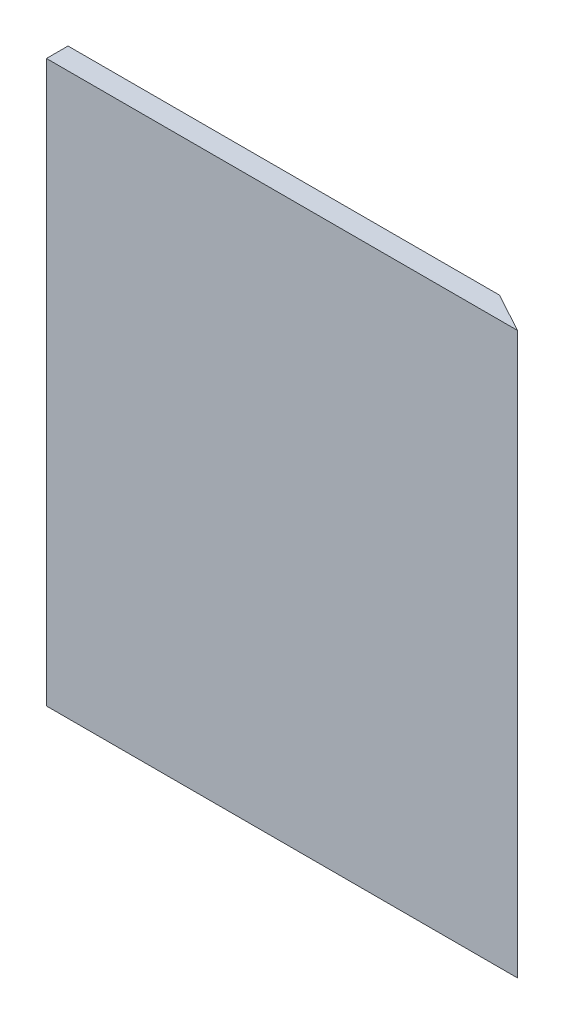
ISO-10303-21;
HEADER;
FILE_DESCRIPTION(('STEP AP214'),'2;1');
FILE_NAME('part.step','',(''),(''),'','','');
FILE_SCHEMA(('AUTOMOTIVE_DESIGN { 1 0 10303 214 1 1 1 1 }'));
ENDSEC;
DATA;
#1=APPLICATION_CONTEXT('core data for automotive mechanical design processes');
#2=APPLICATION_PROTOCOL_DEFINITION('international standard','automotive_design',2000,#1);
#3=PRODUCT_CONTEXT('',#1,'mechanical');
#4=PRODUCT('Part','Part','',(#3));
#5=PRODUCT_RELATED_PRODUCT_CATEGORY('part','',(#4));
#6=PRODUCT_DEFINITION_FORMATION('','',#4);
#7=PRODUCT_DEFINITION_CONTEXT('part definition',#1,'design');
#8=PRODUCT_DEFINITION('design','',#6,#7);
#9=PRODUCT_DEFINITION_SHAPE('','',#8);
#10=(LENGTH_UNIT() NAMED_UNIT(*) SI_UNIT(.MILLI.,.METRE.));
#11=(NAMED_UNIT(*) PLANE_ANGLE_UNIT() SI_UNIT($,.RADIAN.));
#12=(NAMED_UNIT(*) SI_UNIT($,.STERADIAN.) SOLID_ANGLE_UNIT());
#13=UNCERTAINTY_MEASURE_WITH_UNIT(LENGTH_MEASURE(1.E-05),#10,'distance_accuracy_value','');
#14=(GEOMETRIC_REPRESENTATION_CONTEXT(3) GLOBAL_UNCERTAINTY_ASSIGNED_CONTEXT((#13)) GLOBAL_UNIT_ASSIGNED_CONTEXT((#10,
#11,#12)) REPRESENTATION_CONTEXT('',''));
#15=CARTESIAN_POINT('',(0.,0.,0.));
#16=DIRECTION('',(0.,0.,1.));
#17=DIRECTION('',(1.,0.,0.));
#18=AXIS2_PLACEMENT_3D('',#15,#16,#17);
#19=CARTESIAN_POINT('',(-68.7125551201626,330.2,-75.4710408664974));
#20=DIRECTION('',(1.,0.,0.));
#21=DIRECTION('',(0.,0.,-1.));
#22=AXIS2_PLACEMENT_3D('',#19,#20,#21);
#23=PLANE('',#22);
#24=DIRECTION('',(0.,0.,1.));
#25=VECTOR('',#24,1.);
#26=CARTESIAN_POINT('',(-68.7125551201626,0.,-75.4710408664974));
#27=LINE('',#26,#25);
#28=CARTESIAN_POINT('',(-68.7125551201626,0.,-75.4710408664974));
#29=VERTEX_POINT('',#28);
#30=CARTESIAN_POINT('',(-68.7125551201626,0.,-62.7710408664974));
#31=VERTEX_POINT('',#30);
#32=EDGE_CURVE('E116',#29,#31,#27,.T.);
#33=ORIENTED_EDGE('',*,*,#32,.T.);
#34=DIRECTION('',(0.,-1.,0.));
#35=VECTOR('',#34,1.);
#36=CARTESIAN_POINT('',(-68.7125551201626,330.2,-62.7710408664974));
#37=LINE('',#36,#35);
#38=CARTESIAN_POINT('',(-68.7125551201626,330.2,-62.7710408664974));
#39=VERTEX_POINT('',#38);
#40=EDGE_CURVE('E11',#39,#31,#37,.T.);
#41=ORIENTED_EDGE('',*,*,#40,.F.);
#42=DIRECTION('',(0.,0.,1.));
#43=VECTOR('',#42,1.);
#44=CARTESIAN_POINT('',(-68.7125551201626,330.2,-75.4710408664974));
#45=LINE('',#44,#43);
#46=CARTESIAN_POINT('',(-68.7125551201626,330.2,-75.4710408664974));
#47=VERTEX_POINT('',#46);
#48=EDGE_CURVE('E98',#47,#39,#45,.T.);
#49=ORIENTED_EDGE('',*,*,#48,.F.);
#50=DIRECTION('',(0.,-1.,0.));
#51=VECTOR('',#50,1.);
#52=CARTESIAN_POINT('',(-68.7125551201626,330.2,-75.4710408664974));
#53=LINE('',#52,#51);
#54=EDGE_CURVE('E112',#47,#29,#53,.T.);
#55=ORIENTED_EDGE('',*,*,#54,.T.);
#56=EDGE_LOOP('',(#33,#41,#49,#55));
#57=FACE_BOUND('',#56,.T.);
#58=ADVANCED_FACE('F38',(#57),#23,.F.);
#59=CARTESIAN_POINT('',(185.287444879837,330.2,-62.7710408664974));
#60=DIRECTION('',(0.,0.,-1.));
#61=DIRECTION('',(-1.,0.,0.));
#62=AXIS2_PLACEMENT_3D('',#59,#60,#61);
#63=PLANE('',#62);
#64=DIRECTION('',(1.,0.,0.));
#65=VECTOR('',#64,1.);
#66=CARTESIAN_POINT('',(185.287444879837,0.,-62.7710408664974));
#67=LINE('',#66,#65);
#68=CARTESIAN_POINT('',(208.67210313321,0.,-62.7710408664974));
#69=VERTEX_POINT('',#68);
#70=EDGE_CURVE('E103',#31,#69,#67,.T.);
#71=ORIENTED_EDGE('',*,*,#70,.T.);
#72=DIRECTION('',(0.,-1.,0.));
#73=VECTOR('',#72,1.);
#74=CARTESIAN_POINT('',(208.67210313321,330.2,-62.7710408664974));
#75=LINE('',#74,#73);
#76=CARTESIAN_POINT('',(208.67210313321,330.2,-62.7710408664974));
#77=VERTEX_POINT('',#76);
#78=EDGE_CURVE('E47',#77,#69,#75,.T.);
#79=ORIENTED_EDGE('',*,*,#78,.F.);
#80=DIRECTION('',(1.,0.,0.));
#81=VECTOR('',#80,1.);
#82=CARTESIAN_POINT('',(-68.7125551201626,330.2,-62.7710408664974));
#83=LINE('',#82,#81);
#84=EDGE_CURVE('E93',#39,#77,#83,.T.);
#85=ORIENTED_EDGE('',*,*,#84,.F.);
#86=ORIENTED_EDGE('',*,*,#40,.T.);
#87=EDGE_LOOP('',(#71,#79,#85,#86));
#88=FACE_BOUND('',#87,.T.);
#89=ADVANCED_FACE('F102',(#88),#63,.F.);
#90=CARTESIAN_POINT('',(185.287444879837,330.2,-75.4710408664974));
#91=DIRECTION('',(-0.477250658956331,0.,0.878767209518964));
#92=DIRECTION('',(0.878767209518965,0.,0.477250658956331));
#93=AXIS2_PLACEMENT_3D('',#90,#91,#92);
#94=PLANE('',#93);
#95=DIRECTION('',(-0.878767209518965,0.,-0.477250658956331));
#96=VECTOR('',#95,1.);
#97=CARTESIAN_POINT('',(185.287444879837,0.,-75.4710408664974));
#98=LINE('',#97,#96);
#99=CARTESIAN_POINT('',(185.287444879837,0.,-75.4710408664974));
#100=VERTEX_POINT('',#99);
#101=EDGE_CURVE('E78',#69,#100,#98,.T.);
#102=ORIENTED_EDGE('',*,*,#101,.T.);
#103=DIRECTION('',(0.,-1.,0.));
#104=VECTOR('',#103,1.);
#105=CARTESIAN_POINT('',(185.287444879837,330.2,-75.4710408664974));
#106=LINE('',#105,#104);
#107=CARTESIAN_POINT('',(185.287444879837,330.2,-75.4710408664974));
#108=VERTEX_POINT('',#107);
#109=EDGE_CURVE('E105',#108,#100,#106,.T.);
#110=ORIENTED_EDGE('',*,*,#109,.F.);
#111=DIRECTION('',(-0.878767209518965,0.,-0.477250658956331));
#112=VECTOR('',#111,1.);
#113=CARTESIAN_POINT('',(185.287444879837,330.2,-75.4710408664974));
#114=LINE('',#113,#112);
#115=EDGE_CURVE('E96',#77,#108,#114,.T.);
#116=ORIENTED_EDGE('',*,*,#115,.F.);
#117=ORIENTED_EDGE('',*,*,#78,.T.);
#118=EDGE_LOOP('',(#102,#110,#116,#117));
#119=FACE_BOUND('',#118,.T.);
#120=ADVANCED_FACE('F106',(#119),#94,.F.);
#121=CARTESIAN_POINT('',(-68.7125551201626,330.2,-75.4710408664974));
#122=DIRECTION('',(0.,0.,1.));
#123=DIRECTION('',(1.,0.,0.));
#124=AXIS2_PLACEMENT_3D('',#121,#122,#123);
#125=PLANE('',#124);
#126=DIRECTION('',(-1.,0.,0.));
#127=VECTOR('',#126,1.);
#128=CARTESIAN_POINT('',(-68.7125551201626,0.,-75.4710408664974));
#129=LINE('',#128,#127);
#130=EDGE_CURVE('E86',#100,#29,#129,.T.);
#131=ORIENTED_EDGE('',*,*,#130,.T.);
#132=ORIENTED_EDGE('',*,*,#54,.F.);
#133=DIRECTION('',(-1.,0.,0.));
#134=VECTOR('',#133,1.);
#135=CARTESIAN_POINT('',(-68.7125551201626,330.2,-75.4710408664974));
#136=LINE('',#135,#134);
#137=EDGE_CURVE('E58',#108,#47,#136,.T.);
#138=ORIENTED_EDGE('',*,*,#137,.F.);
#139=ORIENTED_EDGE('',*,*,#109,.T.);
#140=EDGE_LOOP('',(#131,#132,#138,#139));
#141=FACE_BOUND('',#140,.T.);
#142=ADVANCED_FACE('F127',(#141),#125,.F.);
#143=CARTESIAN_POINT('',(0.,330.2,0.));
#144=DIRECTION('',(0.,1.,0.));
#145=DIRECTION('',(0.,0.,1.));
#146=AXIS2_PLACEMENT_3D('',#143,#144,#145);
#147=PLANE('',#146);
#148=ORIENTED_EDGE('',*,*,#48,.T.);
#149=ORIENTED_EDGE('',*,*,#84,.T.);
#150=ORIENTED_EDGE('',*,*,#115,.T.);
#151=ORIENTED_EDGE('',*,*,#137,.T.);
#152=EDGE_LOOP('',(#148,#149,#150,#151));
#153=FACE_BOUND('',#152,.T.);
#154=ADVANCED_FACE('F94',(#153),#147,.T.);
#155=CARTESIAN_POINT('',(0.,0.,0.));
#156=DIRECTION('',(0.,1.,0.));
#157=DIRECTION('',(0.,0.,1.));
#158=AXIS2_PLACEMENT_3D('',#155,#156,#157);
#159=PLANE('',#158);
#160=ORIENTED_EDGE('',*,*,#32,.F.);
#161=ORIENTED_EDGE('',*,*,#130,.F.);
#162=ORIENTED_EDGE('',*,*,#101,.F.);
#163=ORIENTED_EDGE('',*,*,#70,.F.);
#164=EDGE_LOOP('',(#160,#161,#162,#163));
#165=FACE_BOUND('',#164,.T.);
#166=ADVANCED_FACE('F130',(#165),#159,.F.);
#167=CLOSED_SHELL('',(#58,#89,#120,#142,#154,#166));
#168=MANIFOLD_SOLID_BREP('B2',#167);
#169=ADVANCED_BREP_SHAPE_REPRESENTATION('',(#18,#168),#14);
#170=SHAPE_DEFINITION_REPRESENTATION(#9,#169);
ENDSEC;
END-ISO-10303-21;
